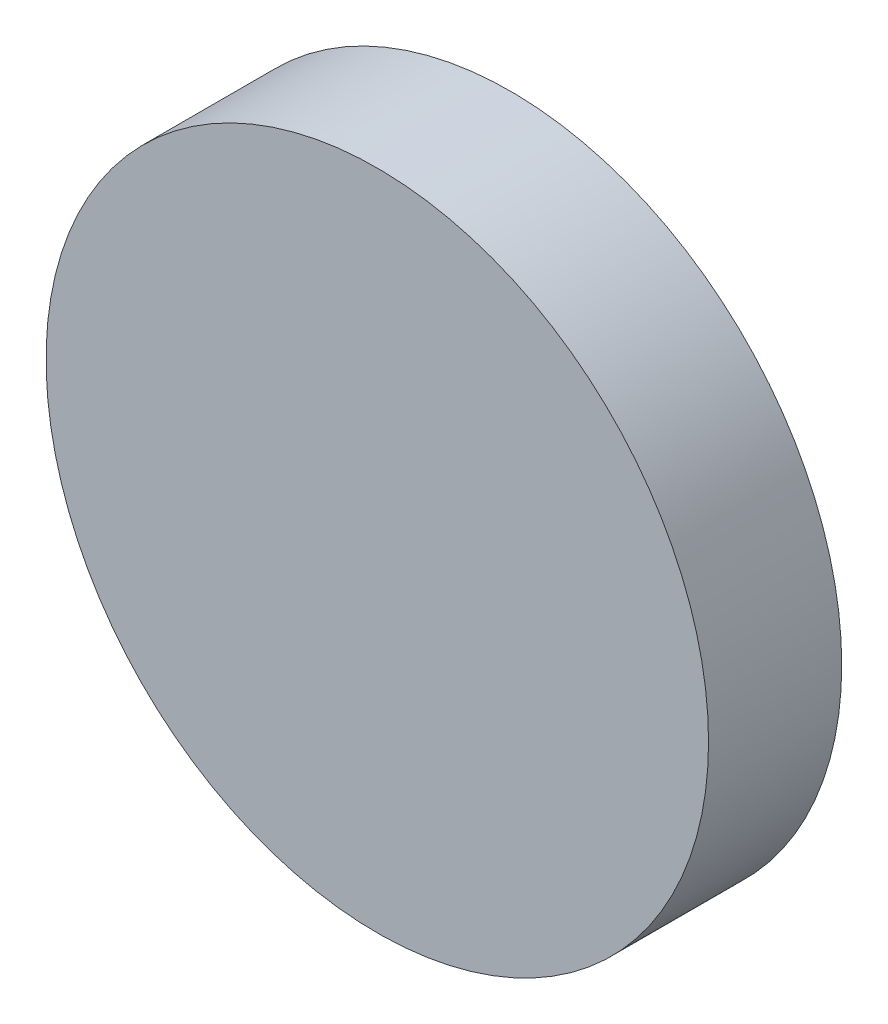
ISO-10303-21;
HEADER;
FILE_DESCRIPTION(('STEP AP214'),'2;1');
FILE_NAME('part.step','',(''),(''),'','','');
FILE_SCHEMA(('AUTOMOTIVE_DESIGN { 1 0 10303 214 1 1 1 1 }'));
ENDSEC;
DATA;
#1=APPLICATION_CONTEXT('core data for automotive mechanical design processes');
#2=APPLICATION_PROTOCOL_DEFINITION('international standard','automotive_design',2000,#1);
#3=PRODUCT_CONTEXT('',#1,'mechanical');
#4=PRODUCT('Part','Part','',(#3));
#5=PRODUCT_RELATED_PRODUCT_CATEGORY('part','',(#4));
#6=PRODUCT_DEFINITION_FORMATION('','',#4);
#7=PRODUCT_DEFINITION_CONTEXT('part definition',#1,'design');
#8=PRODUCT_DEFINITION('design','',#6,#7);
#9=PRODUCT_DEFINITION_SHAPE('','',#8);
#10=(LENGTH_UNIT() NAMED_UNIT(*) SI_UNIT(.MILLI.,.METRE.));
#11=(NAMED_UNIT(*) PLANE_ANGLE_UNIT() SI_UNIT($,.RADIAN.));
#12=(NAMED_UNIT(*) SI_UNIT($,.STERADIAN.) SOLID_ANGLE_UNIT());
#13=UNCERTAINTY_MEASURE_WITH_UNIT(LENGTH_MEASURE(1.E-05),#10,'distance_accuracy_value','');
#14=(GEOMETRIC_REPRESENTATION_CONTEXT(3) GLOBAL_UNCERTAINTY_ASSIGNED_CONTEXT((#13)) GLOBAL_UNIT_ASSIGNED_CONTEXT((#10,
#11,#12)) REPRESENTATION_CONTEXT('',''));
#15=CARTESIAN_POINT('',(0.,0.,0.));
#16=DIRECTION('',(0.,0.,1.));
#17=DIRECTION('',(1.,0.,0.));
#18=AXIS2_PLACEMENT_3D('',#15,#16,#17);
#19=CARTESIAN_POINT('',(0.,0.,24.384));
#20=DIRECTION('',(0.,0.,-1.));
#21=DIRECTION('',(-1.,0.,0.));
#22=AXIS2_PLACEMENT_3D('',#19,#20,#21);
#23=CYLINDRICAL_SURFACE('',#22,60.6425);
#24=CARTESIAN_POINT('',(0.,0.,24.384));
#25=DIRECTION('',(0.,0.,1.));
#26=DIRECTION('',(1.,0.,0.));
#27=AXIS2_PLACEMENT_3D('',#24,#25,#26);
#28=CIRCLE('',#27,60.6425);
#29=CARTESIAN_POINT('',(60.6425,0.,24.384));
#30=VERTEX_POINT('',#29);
#31=EDGE_CURVE('E10',#30,#30,#28,.T.);
#32=ORIENTED_EDGE('',*,*,#31,.F.);
#33=EDGE_LOOP('',(#32));
#34=FACE_BOUND('',#33,.T.);
#35=CARTESIAN_POINT('',(0.,0.,0.));
#36=DIRECTION('',(0.,0.,1.));
#37=DIRECTION('',(1.,0.,0.));
#38=AXIS2_PLACEMENT_3D('',#35,#36,#37);
#39=CIRCLE('',#38,60.6425);
#40=CARTESIAN_POINT('',(60.6425,0.,0.));
#41=VERTEX_POINT('',#40);
#42=EDGE_CURVE('E35',#41,#41,#39,.T.);
#43=ORIENTED_EDGE('',*,*,#42,.T.);
#44=EDGE_LOOP('',(#43));
#45=FACE_BOUND('',#44,.T.);
#46=ADVANCED_FACE('F29',(#34,#45),#23,.T.);
#47=CARTESIAN_POINT('',(0.,0.,24.384));
#48=DIRECTION('',(0.,0.,1.));
#49=DIRECTION('',(1.,0.,0.));
#50=AXIS2_PLACEMENT_3D('',#47,#48,#49);
#51=PLANE('',#50);
#52=ORIENTED_EDGE('',*,*,#31,.T.);
#53=EDGE_LOOP('',(#52));
#54=FACE_BOUND('',#53,.T.);
#55=ADVANCED_FACE('F44',(#54),#51,.T.);
#56=CARTESIAN_POINT('',(0.,0.,0.));
#57=DIRECTION('',(0.,0.,1.));
#58=DIRECTION('',(1.,0.,0.));
#59=AXIS2_PLACEMENT_3D('',#56,#57,#58);
#60=PLANE('',#59);
#61=ORIENTED_EDGE('',*,*,#42,.F.);
#62=EDGE_LOOP('',(#61));
#63=FACE_BOUND('',#62,.T.);
#64=ADVANCED_FACE('F42',(#63),#60,.F.);
#65=CLOSED_SHELL('',(#46,#55,#64));
#66=MANIFOLD_SOLID_BREP('B2',#65);
#67=ADVANCED_BREP_SHAPE_REPRESENTATION('',(#18,#66),#14);
#68=SHAPE_DEFINITION_REPRESENTATION(#9,#67);
ENDSEC;
END-ISO-10303-21;
